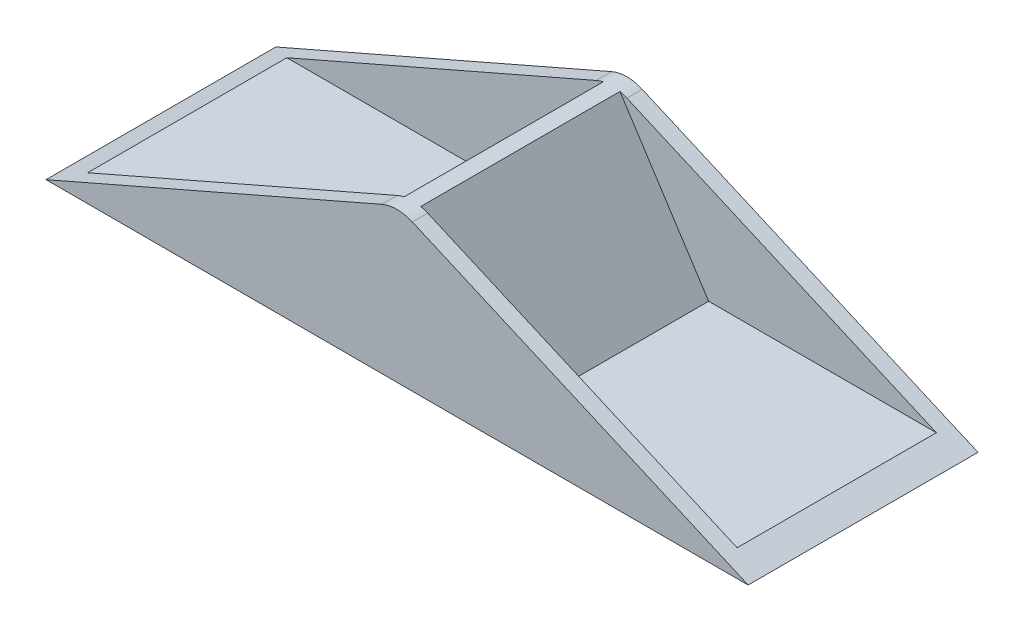
ISO-10303-21;
HEADER;
FILE_DESCRIPTION(('STEP AP214'),'2;1');
FILE_NAME('part.step','',(''),(''),'','','');
FILE_SCHEMA(('AUTOMOTIVE_DESIGN { 1 0 10303 214 1 1 1 1 }'));
ENDSEC;
DATA;
#1=APPLICATION_CONTEXT('core data for automotive mechanical design processes');
#2=APPLICATION_PROTOCOL_DEFINITION('international standard','automotive_design',2000,#1);
#3=PRODUCT_CONTEXT('',#1,'mechanical');
#4=PRODUCT('Part','Part','',(#3));
#5=PRODUCT_RELATED_PRODUCT_CATEGORY('part','',(#4));
#6=PRODUCT_DEFINITION_FORMATION('','',#4);
#7=PRODUCT_DEFINITION_CONTEXT('part definition',#1,'design');
#8=PRODUCT_DEFINITION('design','',#6,#7);
#9=PRODUCT_DEFINITION_SHAPE('','',#8);
#10=(LENGTH_UNIT() NAMED_UNIT(*) SI_UNIT(.MILLI.,.METRE.));
#11=(NAMED_UNIT(*) PLANE_ANGLE_UNIT() SI_UNIT($,.RADIAN.));
#12=(NAMED_UNIT(*) SI_UNIT($,.STERADIAN.) SOLID_ANGLE_UNIT());
#13=UNCERTAINTY_MEASURE_WITH_UNIT(LENGTH_MEASURE(1.E-05),#10,'distance_accuracy_value','');
#14=(GEOMETRIC_REPRESENTATION_CONTEXT(3) GLOBAL_UNCERTAINTY_ASSIGNED_CONTEXT((#13)) GLOBAL_UNIT_ASSIGNED_CONTEXT((#10,
#11,#12)) REPRESENTATION_CONTEXT('',''));
#15=CARTESIAN_POINT('',(0.,0.,0.));
#16=DIRECTION('',(0.,0.,1.));
#17=DIRECTION('',(1.,0.,0.));
#18=AXIS2_PLACEMENT_3D('',#15,#16,#17);
#19=CARTESIAN_POINT('',(-12.5662389811187,0.,30.));
#20=DIRECTION('',(0.000618349914558494,0.999999808821673,0.));
#21=DIRECTION('',(-0.999999808821673,0.000618349914558494,0.));
#22=AXIS2_PLACEMENT_3D('',#19,#20,#21);
#23=PLANE('',#22);
#24=DIRECTION('',(0.999999808821673,-0.000618349914558494,0.));
#25=VECTOR('',#24,1.);
#26=CARTESIAN_POINT('',(-3.94459788843784,-0.00533119205222157,8.75));
#27=LINE('',#26,#25);
#28=CARTESIAN_POINT('',(-3.94459788843784,-0.00533119205222157,8.75));
#29=VERTEX_POINT('',#28);
#30=CARTESIAN_POINT('',(3.55540067772471,-0.00996881641141027,8.75));
#31=VERTEX_POINT('',#30);
#32=EDGE_CURVE('E200',#29,#31,#27,.T.);
#33=ORIENTED_EDGE('',*,*,#32,.F.);
#34=DIRECTION('',(0.,0.,-1.));
#35=VECTOR('',#34,1.);
#36=CARTESIAN_POINT('',(-3.94459788843784,-0.00533119205222157,21.25));
#37=LINE('',#36,#35);
#38=CARTESIAN_POINT('',(-3.94459788843784,-0.00533119205222157,21.25));
#39=VERTEX_POINT('',#38);
#40=EDGE_CURVE('E50',#39,#29,#37,.T.);
#41=ORIENTED_EDGE('',*,*,#40,.F.);
#42=DIRECTION('',(-0.999999808821673,0.000618349914558494,0.));
#43=VECTOR('',#42,1.);
#44=CARTESIAN_POINT('',(-3.94459788843784,-0.00533119205222157,21.25));
#45=LINE('',#44,#43);
#46=CARTESIAN_POINT('',(3.55540067772471,-0.00996881641141027,21.25));
#47=VERTEX_POINT('',#46);
#48=EDGE_CURVE('E191',#47,#39,#45,.T.);
#49=ORIENTED_EDGE('',*,*,#48,.F.);
#50=DIRECTION('',(0.,0.,1.));
#51=VECTOR('',#50,1.);
#52=CARTESIAN_POINT('',(3.55540067772471,-0.00996881641141027,21.25));
#53=LINE('',#52,#51);
#54=EDGE_CURVE('E194',#31,#47,#53,.T.);
#55=ORIENTED_EDGE('',*,*,#54,.F.);
#56=EDGE_LOOP('',(#33,#41,#49,#55));
#57=FACE_BOUND('',#56,.T.);
#58=DIRECTION('',(0.999999808821673,-0.000618349914558494,0.));
#59=VECTOR('',#58,1.);
#60=CARTESIAN_POINT('',(-4.80478462315431E-06,-0.00777033131477712,0.));
#61=LINE('',#60,#59);
#62=CARTESIAN_POINT('',(-12.5631472315459,-9.55891633208639E-07,0.));
#63=VERTEX_POINT('',#62);
#64=CARTESIAN_POINT('',(12.1753990297675,-0.0152989926749036,0.));
#65=VERTEX_POINT('',#64);
#66=EDGE_CURVE('E38',#63,#65,#61,.T.);
#67=ORIENTED_EDGE('',*,*,#66,.T.);
#68=DIRECTION('',(0.,0.,1.));
#69=VECTOR('',#68,1.);
#70=CARTESIAN_POINT('',(12.1753990297675,-0.0152989926749036,30.));
#71=LINE('',#70,#69);
#72=CARTESIAN_POINT('',(12.1753990297675,-0.0152989926749036,30.));
#73=VERTEX_POINT('',#72);
#74=EDGE_CURVE('E318',#73,#65,#71,.F.);
#75=ORIENTED_EDGE('',*,*,#74,.F.);
#76=DIRECTION('',(0.999999808821673,-0.000618349914558494,0.));
#77=VECTOR('',#76,1.);
#78=CARTESIAN_POINT('',(-4.80478462315431E-06,-0.00777033131477712,30.));
#79=LINE('',#78,#77);
#80=CARTESIAN_POINT('',(-12.5631472315459,-9.55891633208639E-07,30.));
#81=VERTEX_POINT('',#80);
#82=EDGE_CURVE('E321',#81,#73,#79,.T.);
#83=ORIENTED_EDGE('',*,*,#82,.F.);
#84=DIRECTION('',(0.,0.,1.));
#85=VECTOR('',#84,1.);
#86=CARTESIAN_POINT('',(-12.5631472318414,-1.43383735873998E-06,30.));
#87=LINE('',#86,#85);
#88=EDGE_CURVE('E11',#81,#63,#87,.F.);
#89=ORIENTED_EDGE('',*,*,#88,.T.);
#90=EDGE_LOOP('',(#67,#75,#83,#89));
#91=FACE_BOUND('',#90,.T.);
#92=ADVANCED_FACE('F35',(#57,#91),#23,.F.);
#93=CARTESIAN_POINT('',(-12.5662389811187,-5.,30.));
#94=DIRECTION('',(0.,0.,1.));
#95=DIRECTION('',(1.,0.,0.));
#96=AXIS2_PLACEMENT_3D('',#93,#94,#95);
#97=CYLINDRICAL_SURFACE('',#96,5.);
#98=ORIENTED_EDGE('',*,*,#88,.F.);
#99=CARTESIAN_POINT('',(-12.5662389811187,-5.,30.));
#100=DIRECTION('',(0.,0.,-1.));
#101=DIRECTION('',(-1.,0.,0.));
#102=AXIS2_PLACEMENT_3D('',#99,#100,#101);
#103=CIRCLE('',#102,5.);
#104=CARTESIAN_POINT('',(-12.5662389811187,0.,30.));
#105=VERTEX_POINT('',#104);
#106=EDGE_CURVE('E290',#105,#81,#103,.T.);
#107=ORIENTED_EDGE('',*,*,#106,.F.);
#108=DIRECTION('',(0.,0.,-1.));
#109=VECTOR('',#108,1.);
#110=CARTESIAN_POINT('',(-12.5662389811187,0.,30.));
#111=LINE('',#110,#109);
#112=CARTESIAN_POINT('',(-12.5662389811187,0.,0.));
#113=VERTEX_POINT('',#112);
#114=EDGE_CURVE('E285',#113,#105,#111,.F.);
#115=ORIENTED_EDGE('',*,*,#114,.F.);
#116=CARTESIAN_POINT('',(-12.5662389811187,-5.,0.));
#117=DIRECTION('',(0.,0.,-1.));
#118=DIRECTION('',(-1.,0.,0.));
#119=AXIS2_PLACEMENT_3D('',#116,#117,#118);
#120=CIRCLE('',#119,5.);
#121=EDGE_CURVE('E288',#63,#113,#120,.F.);
#122=ORIENTED_EDGE('',*,*,#121,.F.);
#123=EDGE_LOOP('',(#98,#107,#115,#122));
#124=FACE_BOUND('',#123,.T.);
#125=ADVANCED_FACE('F366',(#124),#97,.F.);
#126=CARTESIAN_POINT('',(-45.8257569495584,0.,30.));
#127=DIRECTION('',(-0.4,0.916515138991168,0.));
#128=DIRECTION('',(-0.916515138991168,-0.4,0.));
#129=AXIS2_PLACEMENT_3D('',#126,#127,#128);
#130=PLANE('',#129);
#131=DIRECTION('',(0.916515138991168,0.4,0.));
#132=VECTOR('',#131,1.);
#133=CARTESIAN_POINT('',(-45.8257569495584,0.,30.));
#134=LINE('',#133,#132);
#135=CARTESIAN_POINT('',(-45.8257569495584,0.,30.));
#136=VERTEX_POINT('',#135);
#137=CARTESIAN_POINT('',(-2.00000000000002,19.127128439056,30.));
#138=VERTEX_POINT('',#137);
#139=EDGE_CURVE('E233',#136,#138,#134,.T.);
#140=ORIENTED_EDGE('',*,*,#139,.T.);
#141=DIRECTION('',(0.,0.,-1.));
#142=VECTOR('',#141,1.);
#143=CARTESIAN_POINT('',(-2.00000000000001,19.127128439056,0.));
#144=LINE('',#143,#142);
#145=CARTESIAN_POINT('',(-2.,19.127128439056,28.));
#146=VERTEX_POINT('',#145);
#147=EDGE_CURVE('E296',#138,#146,#144,.T.);
#148=ORIENTED_EDGE('',*,*,#147,.T.);
#149=DIRECTION('',(0.916515138991168,0.4,0.));
#150=VECTOR('',#149,1.);
#151=CARTESIAN_POINT('',(-42.3888251783415,1.5,28.));
#152=LINE('',#151,#150);
#153=CARTESIAN_POINT('',(-42.3888251783415,1.5,28.));
#154=VERTEX_POINT('',#153);
#155=EDGE_CURVE('E216',#154,#146,#152,.T.);
#156=ORIENTED_EDGE('',*,*,#155,.F.);
#157=DIRECTION('',(0.,0.,-1.));
#158=VECTOR('',#157,1.);
#159=CARTESIAN_POINT('',(-42.3888251783415,1.5,28.));
#160=LINE('',#159,#158);
#161=CARTESIAN_POINT('',(-42.3888251783415,1.5,2.));
#162=VERTEX_POINT('',#161);
#163=EDGE_CURVE('E219',#154,#162,#160,.T.);
#164=ORIENTED_EDGE('',*,*,#163,.T.);
#165=DIRECTION('',(0.916515138991168,0.4,0.));
#166=VECTOR('',#165,1.);
#167=CARTESIAN_POINT('',(-42.3888251783415,1.5,2.));
#168=LINE('',#167,#166);
#169=CARTESIAN_POINT('',(-2.,19.127128439056,2.));
#170=VERTEX_POINT('',#169);
#171=EDGE_CURVE('E214',#162,#170,#168,.T.);
#172=ORIENTED_EDGE('',*,*,#171,.T.);
#173=DIRECTION('',(0.,0.,-1.));
#174=VECTOR('',#173,1.);
#175=CARTESIAN_POINT('',(-2.00000000000001,19.127128439056,0.));
#176=LINE('',#175,#174);
#177=CARTESIAN_POINT('',(-2.00000000000002,19.127128439056,0.));
#178=VERTEX_POINT('',#177);
#179=EDGE_CURVE('E294',#170,#178,#176,.T.);
#180=ORIENTED_EDGE('',*,*,#179,.T.);
#181=DIRECTION('',(0.916515138991168,0.4,0.));
#182=VECTOR('',#181,1.);
#183=CARTESIAN_POINT('',(-45.8257569495584,0.,0.));
#184=LINE('',#183,#182);
#185=CARTESIAN_POINT('',(-45.8257569495584,0.,0.));
#186=VERTEX_POINT('',#185);
#187=EDGE_CURVE('E234',#186,#178,#184,.T.);
#188=ORIENTED_EDGE('',*,*,#187,.F.);
#189=DIRECTION('',(0.,0.,-1.));
#190=VECTOR('',#189,1.);
#191=CARTESIAN_POINT('',(-45.8257569495584,0.,30.));
#192=LINE('',#191,#190);
#193=EDGE_CURVE('E237',#136,#186,#192,.T.);
#194=ORIENTED_EDGE('',*,*,#193,.F.);
#195=EDGE_LOOP('',(#140,#148,#156,#164,#172,#180,#188,#194));
#196=FACE_BOUND('',#195,.T.);
#197=ADVANCED_FACE('F359',(#196),#130,.T.);
#198=CARTESIAN_POINT('',(45.8257569495584,0.,30.));
#199=DIRECTION('',(-0.4,-0.916515138991168,0.));
#200=DIRECTION('',(0.916515138991168,-0.4,0.));
#201=AXIS2_PLACEMENT_3D('',#198,#199,#200);
#202=PLANE('',#201);
#203=DIRECTION('',(-0.916515138991168,0.4,0.));
#204=VECTOR('',#203,1.);
#205=CARTESIAN_POINT('',(45.8257569495584,0.,0.));
#206=LINE('',#205,#204);
#207=CARTESIAN_POINT('',(45.8257569495584,0.,0.));
#208=VERTEX_POINT('',#207);
#209=CARTESIAN_POINT('',(2.,19.127128439056,0.));
#210=VERTEX_POINT('',#209);
#211=EDGE_CURVE('E268',#208,#210,#206,.T.);
#212=ORIENTED_EDGE('',*,*,#211,.T.);
#213=DIRECTION('',(0.,0.,-1.));
#214=VECTOR('',#213,1.);
#215=CARTESIAN_POINT('',(2.,19.127128439056,30.));
#216=LINE('',#215,#214);
#217=CARTESIAN_POINT('',(1.99999999999999,19.127128439056,2.));
#218=VERTEX_POINT('',#217);
#219=EDGE_CURVE('E309',#210,#218,#216,.F.);
#220=ORIENTED_EDGE('',*,*,#219,.T.);
#221=DIRECTION('',(-0.916515138991168,0.4,0.));
#222=VECTOR('',#221,1.);
#223=CARTESIAN_POINT('',(42.3888251783415,1.5,2.));
#224=LINE('',#223,#222);
#225=CARTESIAN_POINT('',(42.3888251783415,1.5,2.));
#226=VERTEX_POINT('',#225);
#227=EDGE_CURVE('E255',#226,#218,#224,.T.);
#228=ORIENTED_EDGE('',*,*,#227,.F.);
#229=DIRECTION('',(0.,0.,-1.));
#230=VECTOR('',#229,1.);
#231=CARTESIAN_POINT('',(42.3888251783415,1.5,28.));
#232=LINE('',#231,#230);
#233=CARTESIAN_POINT('',(42.3888251783415,1.5,28.));
#234=VERTEX_POINT('',#233);
#235=EDGE_CURVE('E261',#234,#226,#232,.T.);
#236=ORIENTED_EDGE('',*,*,#235,.F.);
#237=DIRECTION('',(-0.916515138991168,0.4,0.));
#238=VECTOR('',#237,1.);
#239=CARTESIAN_POINT('',(42.3888251783415,1.5,28.));
#240=LINE('',#239,#238);
#241=CARTESIAN_POINT('',(1.99999999999999,19.127128439056,28.));
#242=VERTEX_POINT('',#241);
#243=EDGE_CURVE('E247',#234,#242,#240,.T.);
#244=ORIENTED_EDGE('',*,*,#243,.T.);
#245=DIRECTION('',(0.,0.,-1.));
#246=VECTOR('',#245,1.);
#247=CARTESIAN_POINT('',(2.,19.127128439056,30.));
#248=LINE('',#247,#246);
#249=CARTESIAN_POINT('',(2.,19.127128439056,30.));
#250=VERTEX_POINT('',#249);
#251=EDGE_CURVE('E307',#242,#250,#248,.F.);
#252=ORIENTED_EDGE('',*,*,#251,.T.);
#253=DIRECTION('',(-0.916515138991168,0.4,0.));
#254=VECTOR('',#253,1.);
#255=CARTESIAN_POINT('',(45.8257569495584,0.,30.));
#256=LINE('',#255,#254);
#257=CARTESIAN_POINT('',(45.8257569495584,0.,30.));
#258=VERTEX_POINT('',#257);
#259=EDGE_CURVE('E267',#258,#250,#256,.T.);
#260=ORIENTED_EDGE('',*,*,#259,.F.);
#261=DIRECTION('',(0.,0.,-1.));
#262=VECTOR('',#261,1.);
#263=CARTESIAN_POINT('',(45.8257569495584,0.,30.));
#264=LINE('',#263,#262);
#265=EDGE_CURVE('E271',#258,#208,#264,.T.);
#266=ORIENTED_EDGE('',*,*,#265,.T.);
#267=EDGE_LOOP('',(#212,#220,#228,#236,#244,#252,#260,#266));
#268=FACE_BOUND('',#267,.T.);
#269=ADVANCED_FACE('F346',(#268),#202,.F.);
#270=CARTESIAN_POINT('',(9.70678761000199,0.,30.));
#271=DIRECTION('',(0.,1.,0.));
#272=DIRECTION('',(0.,0.,1.));
#273=AXIS2_PLACEMENT_3D('',#270,#271,#272);
#274=PLANE('',#273);
#275=DIRECTION('',(1.,0.,0.));
#276=VECTOR('',#275,1.);
#277=CARTESIAN_POINT('',(9.70678761000199,0.,30.));
#278=LINE('',#277,#276);
#279=CARTESIAN_POINT('',(12.5662389811187,0.,30.));
#280=VERTEX_POINT('',#279);
#281=EDGE_CURVE('E265',#280,#258,#278,.T.);
#282=ORIENTED_EDGE('',*,*,#281,.F.);
#283=DIRECTION('',(0.,0.,-1.));
#284=VECTOR('',#283,1.);
#285=CARTESIAN_POINT('',(12.5662389811187,0.,0.));
#286=LINE('',#285,#284);
#287=CARTESIAN_POINT('',(12.5662389811187,0.,0.));
#288=VERTEX_POINT('',#287);
#289=EDGE_CURVE('E277',#280,#288,#286,.T.);
#290=ORIENTED_EDGE('',*,*,#289,.T.);
#291=DIRECTION('',(1.,0.,0.));
#292=VECTOR('',#291,1.);
#293=CARTESIAN_POINT('',(9.70678761000199,0.,0.));
#294=LINE('',#293,#292);
#295=EDGE_CURVE('E264',#288,#208,#294,.T.);
#296=ORIENTED_EDGE('',*,*,#295,.T.);
#297=ORIENTED_EDGE('',*,*,#265,.F.);
#298=EDGE_LOOP('',(#282,#290,#296,#297));
#299=FACE_BOUND('',#298,.T.);
#300=ADVANCED_FACE('F340',(#299),#274,.F.);
#301=CARTESIAN_POINT('',(0.,0.,30.));
#302=DIRECTION('',(0.,0.,-1.));
#303=DIRECTION('',(-1.,0.,0.));
#304=AXIS2_PLACEMENT_3D('',#301,#302,#303);
#305=PLANE('',#304);
#306=ORIENTED_EDGE('',*,*,#106,.T.);
#307=ORIENTED_EDGE('',*,*,#82,.T.);
#308=CARTESIAN_POINT('',(12.5662389811187,-5.,30.));
#309=DIRECTION('',(0.,0.,-1.));
#310=DIRECTION('',(-1.,0.,0.));
#311=AXIS2_PLACEMENT_3D('',#308,#309,#310);
#312=CIRCLE('',#311,5.);
#313=EDGE_CURVE('E283',#73,#280,#312,.T.);
#314=ORIENTED_EDGE('',*,*,#313,.T.);
#315=ORIENTED_EDGE('',*,*,#281,.T.);
#316=ORIENTED_EDGE('',*,*,#259,.T.);
#317=CARTESIAN_POINT('',(0.,14.5445527441002,30.));
#318=DIRECTION('',(0.,0.,-1.));
#319=DIRECTION('',(-1.,0.,0.));
#320=AXIS2_PLACEMENT_3D('',#317,#318,#319);
#321=CIRCLE('',#320,5.);
#322=EDGE_CURVE('E317',#250,#138,#321,.F.);
#323=ORIENTED_EDGE('',*,*,#322,.T.);
#324=ORIENTED_EDGE('',*,*,#139,.F.);
#325=DIRECTION('',(-1.,0.,0.));
#326=VECTOR('',#325,1.);
#327=CARTESIAN_POINT('',(-9.70678761000199,0.,30.));
#328=LINE('',#327,#326);
#329=EDGE_CURVE('E231',#105,#136,#328,.T.);
#330=ORIENTED_EDGE('',*,*,#329,.F.);
#331=EDGE_LOOP('',(#306,#307,#314,#315,#316,#323,#324,#330));
#332=FACE_BOUND('',#331,.T.);
#333=ADVANCED_FACE('F343',(#332),#305,.F.);
#334=CARTESIAN_POINT('',(0.,0.,0.));
#335=DIRECTION('',(0.,0.,-1.));
#336=DIRECTION('',(-1.,0.,0.));
#337=AXIS2_PLACEMENT_3D('',#334,#335,#336);
#338=PLANE('',#337);
#339=ORIENTED_EDGE('',*,*,#66,.F.);
#340=ORIENTED_EDGE('',*,*,#121,.T.);
#341=DIRECTION('',(-1.,0.,0.));
#342=VECTOR('',#341,1.);
#343=CARTESIAN_POINT('',(-9.70678761000199,0.,0.));
#344=LINE('',#343,#342);
#345=EDGE_CURVE('E230',#113,#186,#344,.T.);
#346=ORIENTED_EDGE('',*,*,#345,.T.);
#347=ORIENTED_EDGE('',*,*,#187,.T.);
#348=CARTESIAN_POINT('',(0.,14.5445527441002,0.));
#349=DIRECTION('',(0.,0.,-1.));
#350=DIRECTION('',(-1.,0.,0.));
#351=AXIS2_PLACEMENT_3D('',#348,#349,#350);
#352=CIRCLE('',#351,5.);
#353=EDGE_CURVE('E305',#178,#210,#352,.T.);
#354=ORIENTED_EDGE('',*,*,#353,.T.);
#355=ORIENTED_EDGE('',*,*,#211,.F.);
#356=ORIENTED_EDGE('',*,*,#295,.F.);
#357=CARTESIAN_POINT('',(12.5662389811187,-5.,0.));
#358=DIRECTION('',(0.,0.,-1.));
#359=DIRECTION('',(-1.,0.,0.));
#360=AXIS2_PLACEMENT_3D('',#357,#358,#359);
#361=CIRCLE('',#360,5.);
#362=EDGE_CURVE('E280',#288,#65,#361,.F.);
#363=ORIENTED_EDGE('',*,*,#362,.T.);
#364=EDGE_LOOP('',(#339,#340,#346,#347,#354,#355,#356,#363));
#365=FACE_BOUND('',#364,.T.);
#366=ADVANCED_FACE('F333',(#365),#338,.T.);
#367=CARTESIAN_POINT('',(12.6638456497563,1.5,28.));
#368=DIRECTION('',(0.,1.,0.));
#369=DIRECTION('',(0.,0.,1.));
#370=AXIS2_PLACEMENT_3D('',#367,#368,#369);
#371=PLANE('',#370);
#372=DIRECTION('',(1.,0.,0.));
#373=VECTOR('',#372,1.);
#374=CARTESIAN_POINT('',(12.6638456497563,1.5,2.));
#375=LINE('',#374,#373);
#376=CARTESIAN_POINT('',(12.6638456497563,1.5,2.));
#377=VERTEX_POINT('',#376);
#378=EDGE_CURVE('E243',#377,#226,#375,.T.);
#379=ORIENTED_EDGE('',*,*,#378,.F.);
#380=DIRECTION('',(0.,0.,-1.));
#381=VECTOR('',#380,1.);
#382=CARTESIAN_POINT('',(12.6638456497563,1.5,28.));
#383=LINE('',#382,#381);
#384=CARTESIAN_POINT('',(12.6638456497563,1.5,28.));
#385=VERTEX_POINT('',#384);
#386=EDGE_CURVE('E253',#385,#377,#383,.T.);
#387=ORIENTED_EDGE('',*,*,#386,.F.);
#388=DIRECTION('',(1.,0.,0.));
#389=VECTOR('',#388,1.);
#390=CARTESIAN_POINT('',(12.6638456497563,1.5,28.));
#391=LINE('',#390,#389);
#392=EDGE_CURVE('E244',#385,#234,#391,.T.);
#393=ORIENTED_EDGE('',*,*,#392,.T.);
#394=ORIENTED_EDGE('',*,*,#235,.T.);
#395=EDGE_LOOP('',(#379,#387,#393,#394));
#396=FACE_BOUND('',#395,.T.);
#397=ADVANCED_FACE('F378',(#396),#371,.T.);
#398=CARTESIAN_POINT('',(1.,19.563564219528,28.));
#399=DIRECTION('',(0.84008613666888,0.542453023751141,0.));
#400=DIRECTION('',(-0.542453023751141,0.84008613666888,0.));
#401=AXIS2_PLACEMENT_3D('',#398,#399,#400);
#402=PLANE('',#401);
#403=DIRECTION('',(0.542453023751141,-0.84008613666888,0.));
#404=VECTOR('',#403,1.);
#405=CARTESIAN_POINT('',(1.,19.563564219528,2.));
#406=LINE('',#405,#404);
#407=CARTESIAN_POINT('',(1.08991430857097,19.4243157301449,2.));
#408=VERTEX_POINT('',#407);
#409=EDGE_CURVE('E248',#408,#377,#406,.T.);
#410=ORIENTED_EDGE('',*,*,#409,.F.);
#411=DIRECTION('',(0.,0.,1.));
#412=VECTOR('',#411,1.);
#413=CARTESIAN_POINT('',(1.08991430857097,19.4243157301449,2.));
#414=LINE('',#413,#412);
#415=CARTESIAN_POINT('',(1.08991430857097,19.4243157301449,28.));
#416=VERTEX_POINT('',#415);
#417=EDGE_CURVE('E313',#408,#416,#414,.T.);
#418=ORIENTED_EDGE('',*,*,#417,.T.);
#419=DIRECTION('',(0.542453023751141,-0.84008613666888,0.));
#420=VECTOR('',#419,1.);
#421=CARTESIAN_POINT('',(1.,19.563564219528,28.));
#422=LINE('',#421,#420);
#423=EDGE_CURVE('E251',#416,#385,#422,.T.);
#424=ORIENTED_EDGE('',*,*,#423,.T.);
#425=ORIENTED_EDGE('',*,*,#386,.T.);
#426=EDGE_LOOP('',(#410,#418,#424,#425));
#427=FACE_BOUND('',#426,.T.);
#428=ADVANCED_FACE('F384',(#427),#402,.T.);
#429=CARTESIAN_POINT('',(0.,0.,28.));
#430=DIRECTION('',(0.,0.,-1.));
#431=DIRECTION('',(-1.,0.,0.));
#432=AXIS2_PLACEMENT_3D('',#429,#430,#431);
#433=PLANE('',#432);
#434=ORIENTED_EDGE('',*,*,#423,.F.);
#435=CARTESIAN_POINT('',(0.,14.5445527441002,28.));
#436=DIRECTION('',(0.,0.,-1.));
#437=DIRECTION('',(-1.,0.,0.));
#438=AXIS2_PLACEMENT_3D('',#435,#436,#437);
#439=CIRCLE('',#438,5.);
#440=EDGE_CURVE('E315',#416,#242,#439,.T.);
#441=ORIENTED_EDGE('',*,*,#440,.T.);
#442=ORIENTED_EDGE('',*,*,#243,.F.);
#443=ORIENTED_EDGE('',*,*,#392,.F.);
#444=EDGE_LOOP('',(#434,#441,#442,#443));
#445=FACE_BOUND('',#444,.T.);
#446=ADVANCED_FACE('F382',(#445),#433,.T.);
#447=CARTESIAN_POINT('',(0.,0.,2.));
#448=DIRECTION('',(0.,0.,-1.));
#449=DIRECTION('',(-1.,0.,0.));
#450=AXIS2_PLACEMENT_3D('',#447,#448,#449);
#451=PLANE('',#450);
#452=ORIENTED_EDGE('',*,*,#227,.T.);
#453=CARTESIAN_POINT('',(0.,14.5445527441002,2.));
#454=DIRECTION('',(0.,0.,-1.));
#455=DIRECTION('',(-1.,0.,0.));
#456=AXIS2_PLACEMENT_3D('',#453,#454,#455);
#457=CIRCLE('',#456,5.);
#458=EDGE_CURVE('E311',#218,#408,#457,.F.);
#459=ORIENTED_EDGE('',*,*,#458,.T.);
#460=ORIENTED_EDGE('',*,*,#409,.T.);
#461=ORIENTED_EDGE('',*,*,#378,.T.);
#462=EDGE_LOOP('',(#452,#459,#460,#461));
#463=FACE_BOUND('',#462,.T.);
#464=ADVANCED_FACE('F373',(#463),#451,.F.);
#465=CARTESIAN_POINT('',(12.5662389811187,-5.,30.));
#466=DIRECTION('',(0.,0.,1.));
#467=DIRECTION('',(1.,0.,0.));
#468=AXIS2_PLACEMENT_3D('',#465,#466,#467);
#469=CYLINDRICAL_SURFACE('',#468,5.);
#470=ORIENTED_EDGE('',*,*,#313,.F.);
#471=ORIENTED_EDGE('',*,*,#74,.T.);
#472=ORIENTED_EDGE('',*,*,#362,.F.);
#473=ORIENTED_EDGE('',*,*,#289,.F.);
#474=EDGE_LOOP('',(#470,#471,#472,#473));
#475=FACE_BOUND('',#474,.T.);
#476=ADVANCED_FACE('F337',(#475),#469,.F.);
#477=CARTESIAN_POINT('',(-9.70678761000199,0.,30.));
#478=DIRECTION('',(0.,-1.,0.));
#479=DIRECTION('',(0.,0.,-1.));
#480=AXIS2_PLACEMENT_3D('',#477,#478,#479);
#481=PLANE('',#480);
#482=ORIENTED_EDGE('',*,*,#345,.F.);
#483=ORIENTED_EDGE('',*,*,#114,.T.);
#484=ORIENTED_EDGE('',*,*,#329,.T.);
#485=ORIENTED_EDGE('',*,*,#193,.T.);
#486=EDGE_LOOP('',(#482,#483,#484,#485));
#487=FACE_BOUND('',#486,.T.);
#488=ADVANCED_FACE('F364',(#487),#481,.T.);
#489=CARTESIAN_POINT('',(-12.6638456497563,1.5,28.));
#490=DIRECTION('',(0.,-1.,0.));
#491=DIRECTION('',(0.,0.,-1.));
#492=AXIS2_PLACEMENT_3D('',#489,#490,#491);
#493=PLANE('',#492);
#494=DIRECTION('',(-1.,0.,0.));
#495=VECTOR('',#494,1.);
#496=CARTESIAN_POINT('',(-12.6638456497563,1.5,2.));
#497=LINE('',#496,#495);
#498=CARTESIAN_POINT('',(-12.6638456497563,1.5,2.));
#499=VERTEX_POINT('',#498);
#500=EDGE_CURVE('E206',#499,#162,#497,.T.);
#501=ORIENTED_EDGE('',*,*,#500,.T.);
#502=ORIENTED_EDGE('',*,*,#163,.F.);
#503=DIRECTION('',(-1.,0.,0.));
#504=VECTOR('',#503,1.);
#505=CARTESIAN_POINT('',(-12.6638456497563,1.5,28.));
#506=LINE('',#505,#504);
#507=CARTESIAN_POINT('',(-12.6638456497563,1.5,28.));
#508=VERTEX_POINT('',#507);
#509=EDGE_CURVE('E210',#508,#154,#506,.T.);
#510=ORIENTED_EDGE('',*,*,#509,.F.);
#511=DIRECTION('',(0.,0.,-1.));
#512=VECTOR('',#511,1.);
#513=CARTESIAN_POINT('',(-12.6638456497563,1.5,28.));
#514=LINE('',#513,#512);
#515=EDGE_CURVE('E227',#508,#499,#514,.T.);
#516=ORIENTED_EDGE('',*,*,#515,.T.);
#517=EDGE_LOOP('',(#501,#502,#510,#516));
#518=FACE_BOUND('',#517,.T.);
#519=ADVANCED_FACE('F447',(#518),#493,.F.);
#520=CARTESIAN_POINT('',(-1.,19.563564219528,28.));
#521=DIRECTION('',(0.84008613666888,-0.542453023751141,0.));
#522=DIRECTION('',(0.542453023751141,0.84008613666888,0.));
#523=AXIS2_PLACEMENT_3D('',#520,#521,#522);
#524=PLANE('',#523);
#525=DIRECTION('',(-0.542453023751141,-0.84008613666888,0.));
#526=VECTOR('',#525,1.);
#527=CARTESIAN_POINT('',(-1.,19.563564219528,28.));
#528=LINE('',#527,#526);
#529=CARTESIAN_POINT('',(-1.08991430857096,19.4243157301449,28.));
#530=VERTEX_POINT('',#529);
#531=EDGE_CURVE('E213',#530,#508,#528,.T.);
#532=ORIENTED_EDGE('',*,*,#531,.F.);
#533=DIRECTION('',(0.,0.,1.));
#534=VECTOR('',#533,1.);
#535=CARTESIAN_POINT('',(-1.08991430857096,19.4243157301449,28.));
#536=LINE('',#535,#534);
#537=CARTESIAN_POINT('',(-1.08991430857096,19.4243157301449,2.));
#538=VERTEX_POINT('',#537);
#539=EDGE_CURVE('E301',#530,#538,#536,.F.);
#540=ORIENTED_EDGE('',*,*,#539,.T.);
#541=DIRECTION('',(-0.542453023751141,-0.84008613666888,0.));
#542=VECTOR('',#541,1.);
#543=CARTESIAN_POINT('',(-1.,19.563564219528,2.));
#544=LINE('',#543,#542);
#545=EDGE_CURVE('E221',#538,#499,#544,.T.);
#546=ORIENTED_EDGE('',*,*,#545,.T.);
#547=ORIENTED_EDGE('',*,*,#515,.F.);
#548=EDGE_LOOP('',(#532,#540,#546,#547));
#549=FACE_BOUND('',#548,.T.);
#550=ADVANCED_FACE('F459',(#549),#524,.F.);
#551=CARTESIAN_POINT('',(0.,0.,28.));
#552=DIRECTION('',(0.,0.,-1.));
#553=DIRECTION('',(1.,0.,0.));
#554=AXIS2_PLACEMENT_3D('',#551,#552,#553);
#555=PLANE('',#554);
#556=ORIENTED_EDGE('',*,*,#155,.T.);
#557=CARTESIAN_POINT('',(0.,14.5445527441002,28.));
#558=DIRECTION('',(0.,0.,-1.));
#559=DIRECTION('',(-1.,0.,0.));
#560=AXIS2_PLACEMENT_3D('',#557,#558,#559);
#561=CIRCLE('',#560,5.);
#562=EDGE_CURVE('E299',#146,#530,#561,.T.);
#563=ORIENTED_EDGE('',*,*,#562,.T.);
#564=ORIENTED_EDGE('',*,*,#531,.T.);
#565=ORIENTED_EDGE('',*,*,#509,.T.);
#566=EDGE_LOOP('',(#556,#563,#564,#565));
#567=FACE_BOUND('',#566,.T.);
#568=ADVANCED_FACE('F413',(#567),#555,.T.);
#569=CARTESIAN_POINT('',(0.,0.,2.));
#570=DIRECTION('',(0.,0.,-1.));
#571=DIRECTION('',(1.,0.,0.));
#572=AXIS2_PLACEMENT_3D('',#569,#570,#571);
#573=PLANE('',#572);
#574=ORIENTED_EDGE('',*,*,#545,.F.);
#575=CARTESIAN_POINT('',(0.,14.5445527441002,2.));
#576=DIRECTION('',(0.,0.,-1.));
#577=DIRECTION('',(-1.,0.,0.));
#578=AXIS2_PLACEMENT_3D('',#575,#576,#577);
#579=CIRCLE('',#578,5.);
#580=EDGE_CURVE('E303',#538,#170,#579,.F.);
#581=ORIENTED_EDGE('',*,*,#580,.T.);
#582=ORIENTED_EDGE('',*,*,#171,.F.);
#583=ORIENTED_EDGE('',*,*,#500,.F.);
#584=EDGE_LOOP('',(#574,#581,#582,#583));
#585=FACE_BOUND('',#584,.T.);
#586=ADVANCED_FACE('F404',(#585),#573,.F.);
#587=CARTESIAN_POINT('',(0.,14.5445527441002,30.));
#588=DIRECTION('',(0.,0.,1.));
#589=DIRECTION('',(1.,0.,0.));
#590=AXIS2_PLACEMENT_3D('',#587,#588,#589);
#591=CYLINDRICAL_SURFACE('',#590,5.);
#592=ORIENTED_EDGE('',*,*,#458,.F.);
#593=ORIENTED_EDGE('',*,*,#219,.F.);
#594=ORIENTED_EDGE('',*,*,#353,.F.);
#595=ORIENTED_EDGE('',*,*,#179,.F.);
#596=ORIENTED_EDGE('',*,*,#580,.F.);
#597=ORIENTED_EDGE('',*,*,#539,.F.);
#598=ORIENTED_EDGE('',*,*,#562,.F.);
#599=ORIENTED_EDGE('',*,*,#147,.F.);
#600=ORIENTED_EDGE('',*,*,#322,.F.);
#601=ORIENTED_EDGE('',*,*,#251,.F.);
#602=ORIENTED_EDGE('',*,*,#440,.F.);
#603=ORIENTED_EDGE('',*,*,#417,.F.);
#604=EDGE_LOOP('',(#592,#593,#594,#595,#596,#597,#598,#599,#600,#601,#602,#603));
#605=FACE_BOUND('',#604,.T.);
#606=ADVANCED_FACE('F352',(#605),#591,.T.);
#607=CARTESIAN_POINT('',(-3.94026943903594,6.99466746969949,21.25));
#608=DIRECTION('',(-0.999999808821673,0.000618349914558494,0.));
#609=DIRECTION('',(-0.000618349914558494,-0.999999808821673,0.));
#610=AXIS2_PLACEMENT_3D('',#607,#608,#609);
#611=PLANE('',#610);
#612=ORIENTED_EDGE('',*,*,#40,.T.);
#613=DIRECTION('',(-0.000618349914558494,-0.999999808821673,0.));
#614=VECTOR('',#613,1.);
#615=CARTESIAN_POINT('',(-3.94026943903593,6.99466746969949,8.75));
#616=LINE('',#615,#614);
#617=CARTESIAN_POINT('',(-3.94026943903593,6.99466746969949,8.75));
#618=VERTEX_POINT('',#617);
#619=EDGE_CURVE('E169',#618,#29,#616,.T.);
#620=ORIENTED_EDGE('',*,*,#619,.F.);
#621=DIRECTION('',(0.,0.,-1.));
#622=VECTOR('',#621,1.);
#623=CARTESIAN_POINT('',(-3.94026943903594,6.99466746969949,21.25));
#624=LINE('',#623,#622);
#625=CARTESIAN_POINT('',(-3.94026943903594,6.99466746969949,21.25));
#626=VERTEX_POINT('',#625);
#627=EDGE_CURVE('E173',#626,#618,#624,.T.);
#628=ORIENTED_EDGE('',*,*,#627,.F.);
#629=DIRECTION('',(-0.000618349914558494,-0.999999808821673,0.));
#630=VECTOR('',#629,1.);
#631=CARTESIAN_POINT('',(-3.94026943903594,6.99466746969949,21.25));
#632=LINE('',#631,#630);
#633=EDGE_CURVE('E204',#626,#39,#632,.T.);
#634=ORIENTED_EDGE('',*,*,#633,.T.);
#635=EDGE_LOOP('',(#612,#620,#628,#634));
#636=FACE_BOUND('',#635,.T.);
#637=ADVANCED_FACE('F171',(#636),#611,.F.);
#638=CARTESIAN_POINT('',(-3.94026943903594,6.99466746969949,21.25));
#639=DIRECTION('',(0.,0.,1.));
#640=DIRECTION('',(1.,0.,0.));
#641=AXIS2_PLACEMENT_3D('',#638,#639,#640);
#642=PLANE('',#641);
#643=ORIENTED_EDGE('',*,*,#48,.T.);
#644=ORIENTED_EDGE('',*,*,#633,.F.);
#645=DIRECTION('',(-0.999999808821673,0.000618349914558494,0.));
#646=VECTOR('',#645,1.);
#647=CARTESIAN_POINT('',(-3.94026943903594,6.99466746969949,21.25));
#648=LINE('',#647,#646);
#649=CARTESIAN_POINT('',(3.55972912712662,6.9900298453403,21.25));
#650=VERTEX_POINT('',#649);
#651=EDGE_CURVE('E179',#650,#626,#648,.T.);
#652=ORIENTED_EDGE('',*,*,#651,.F.);
#653=DIRECTION('',(-0.000618349914558494,-0.999999808821673,0.));
#654=VECTOR('',#653,1.);
#655=CARTESIAN_POINT('',(3.55972912712662,6.9900298453403,21.25));
#656=LINE('',#655,#654);
#657=EDGE_CURVE('E207',#650,#47,#656,.T.);
#658=ORIENTED_EDGE('',*,*,#657,.T.);
#659=EDGE_LOOP('',(#643,#644,#652,#658));
#660=FACE_BOUND('',#659,.T.);
#661=ADVANCED_FACE('F411',(#660),#642,.F.);
#662=CARTESIAN_POINT('',(3.55972912712662,6.9900298453403,21.25));
#663=DIRECTION('',(0.999999808821673,-0.000618349914558494,0.));
#664=DIRECTION('',(0.000618349914558494,0.999999808821673,0.));
#665=AXIS2_PLACEMENT_3D('',#662,#663,#664);
#666=PLANE('',#665);
#667=ORIENTED_EDGE('',*,*,#54,.T.);
#668=ORIENTED_EDGE('',*,*,#657,.F.);
#669=DIRECTION('',(0.,0.,1.));
#670=VECTOR('',#669,1.);
#671=CARTESIAN_POINT('',(3.55972912712662,6.9900298453403,21.25));
#672=LINE('',#671,#670);
#673=CARTESIAN_POINT('',(3.55972912712662,6.9900298453403,8.75));
#674=VERTEX_POINT('',#673);
#675=EDGE_CURVE('E187',#674,#650,#672,.T.);
#676=ORIENTED_EDGE('',*,*,#675,.F.);
#677=DIRECTION('',(-0.000618349914558494,-0.999999808821673,0.));
#678=VECTOR('',#677,1.);
#679=CARTESIAN_POINT('',(3.55972912712662,6.9900298453403,8.75));
#680=LINE('',#679,#678);
#681=EDGE_CURVE('E178',#674,#31,#680,.T.);
#682=ORIENTED_EDGE('',*,*,#681,.T.);
#683=EDGE_LOOP('',(#667,#668,#676,#682));
#684=FACE_BOUND('',#683,.T.);
#685=ADVANCED_FACE('F521',(#684),#666,.F.);
#686=CARTESIAN_POINT('',(-3.94026943903593,6.99466746969949,8.75));
#687=DIRECTION('',(0.,0.,-1.));
#688=DIRECTION('',(-1.,0.,0.));
#689=AXIS2_PLACEMENT_3D('',#686,#687,#688);
#690=PLANE('',#689);
#691=ORIENTED_EDGE('',*,*,#32,.T.);
#692=ORIENTED_EDGE('',*,*,#681,.F.);
#693=DIRECTION('',(0.999999808821673,-0.000618349914558494,0.));
#694=VECTOR('',#693,1.);
#695=CARTESIAN_POINT('',(-3.94026943903593,6.99466746969949,8.75));
#696=LINE('',#695,#694);
#697=EDGE_CURVE('E182',#618,#674,#696,.T.);
#698=ORIENTED_EDGE('',*,*,#697,.F.);
#699=ORIENTED_EDGE('',*,*,#619,.T.);
#700=EDGE_LOOP('',(#691,#692,#698,#699));
#701=FACE_BOUND('',#700,.T.);
#702=ADVANCED_FACE('F183',(#701),#690,.F.);
#703=CARTESIAN_POINT('',(0.00432364461728631,6.99222833043694,0.));
#704=DIRECTION('',(-0.000618349914558494,-0.999999808821673,0.));
#705=DIRECTION('',(0.999999808821673,-0.000618349914558494,0.));
#706=AXIS2_PLACEMENT_3D('',#703,#704,#705);
#707=PLANE('',#706);
#708=ORIENTED_EDGE('',*,*,#627,.T.);
#709=ORIENTED_EDGE('',*,*,#697,.T.);
#710=ORIENTED_EDGE('',*,*,#675,.T.);
#711=ORIENTED_EDGE('',*,*,#651,.T.);
#712=EDGE_LOOP('',(#708,#709,#710,#711));
#713=FACE_BOUND('',#712,.T.);
#714=ADVANCED_FACE('F189',(#713),#707,.T.);
#715=CLOSED_SHELL('',(#92,#125,#197,#269,#300,#333,#366,#397,#428,#446,#464,#476,#488,#519,#550,
#568,#586,#606,#637,#661,#685,#702,#714));
#716=MANIFOLD_SOLID_BREP('B2',#715);
#717=ADVANCED_BREP_SHAPE_REPRESENTATION('',(#18,#716),#14);
#718=SHAPE_DEFINITION_REPRESENTATION(#9,#717);
ENDSEC;
END-ISO-10303-21;
